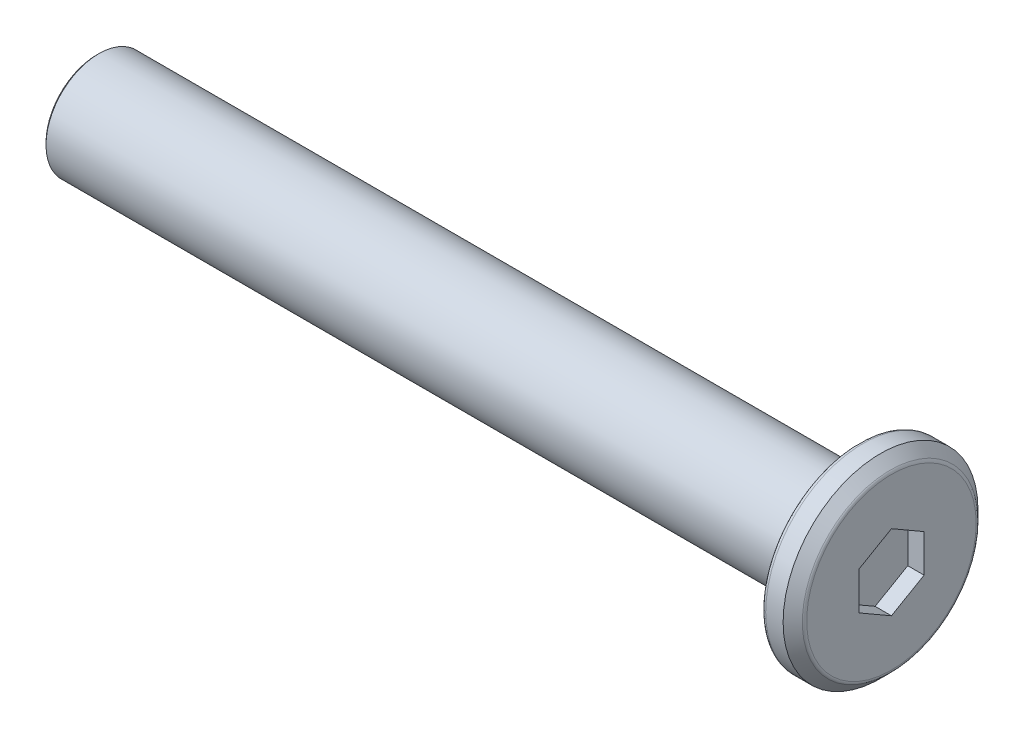
ISO-10303-21;
HEADER;
FILE_DESCRIPTION(('STEP AP214'),'2;1');
FILE_NAME('part.step','',(''),(''),'','','');
FILE_SCHEMA(('AUTOMOTIVE_DESIGN { 1 0 10303 214 1 1 1 1 }'));
ENDSEC;
DATA;
#1=APPLICATION_CONTEXT('core data for automotive mechanical design processes');
#2=APPLICATION_PROTOCOL_DEFINITION('international standard','automotive_design',2000,#1);
#3=PRODUCT_CONTEXT('',#1,'mechanical');
#4=PRODUCT('Part','Part','',(#3));
#5=PRODUCT_RELATED_PRODUCT_CATEGORY('part','',(#4));
#6=PRODUCT_DEFINITION_FORMATION('','',#4);
#7=PRODUCT_DEFINITION_CONTEXT('part definition',#1,'design');
#8=PRODUCT_DEFINITION('design','',#6,#7);
#9=PRODUCT_DEFINITION_SHAPE('','',#8);
#10=(LENGTH_UNIT() NAMED_UNIT(*) SI_UNIT(.MILLI.,.METRE.));
#11=(NAMED_UNIT(*) PLANE_ANGLE_UNIT() SI_UNIT($,.RADIAN.));
#12=(NAMED_UNIT(*) SI_UNIT($,.STERADIAN.) SOLID_ANGLE_UNIT());
#13=UNCERTAINTY_MEASURE_WITH_UNIT(LENGTH_MEASURE(1.E-05),#10,'distance_accuracy_value','');
#14=(GEOMETRIC_REPRESENTATION_CONTEXT(3) GLOBAL_UNCERTAINTY_ASSIGNED_CONTEXT((#13)) GLOBAL_UNIT_ASSIGNED_CONTEXT((#10,
#11,#12)) REPRESENTATION_CONTEXT('',''));
#15=CARTESIAN_POINT('',(0.,0.,0.));
#16=DIRECTION('',(0.,0.,1.));
#17=DIRECTION('',(1.,0.,0.));
#18=AXIS2_PLACEMENT_3D('',#15,#16,#17);
#19=CARTESIAN_POINT('',(16.7014355970759,1.29837341347638,0.250401994321692));
#20=DIRECTION('',(1.,0.,0.));
#21=DIRECTION('',(0.,0.,-1.));
#22=AXIS2_PLACEMENT_3D('',#19,#20,#21);
#23=PLANE('',#22);
#24=CARTESIAN_POINT('',(16.7014355970759,1.29837341347638,0.250401994321692));
#25=DIRECTION('',(1.,0.,0.));
#26=DIRECTION('',(0.,0.,-1.));
#27=AXIS2_PLACEMENT_3D('',#24,#25,#26);
#28=CIRCLE('',#27,3.89215728752538);
#29=CARTESIAN_POINT('',(16.7014355970759,1.29837341347638,-3.64175529320369));
#30=VERTEX_POINT('',#29);
#31=EDGE_CURVE('E132',#30,#30,#28,.T.);
#32=ORIENTED_EDGE('',*,*,#31,.T.);
#33=EDGE_LOOP('',(#32));
#34=FACE_BOUND('',#33,.T.);
#35=DIRECTION('',(0.,-1.,0.));
#36=VECTOR('',#35,1.);
#37=CARTESIAN_POINT('',(16.7014355970759,1.29837341347638,-1.24959800567831));
#38=LINE('',#37,#36);
#39=CARTESIAN_POINT('',(16.7014355970759,2.16439881726082,-1.24959800567831));
#40=VERTEX_POINT('',#39);
#41=CARTESIAN_POINT('',(16.7014355970759,0.432348009691944,-1.24959800567831));
#42=VERTEX_POINT('',#41);
#43=EDGE_CURVE('E120',#40,#42,#38,.T.);
#44=ORIENTED_EDGE('',*,*,#43,.T.);
#45=DIRECTION('',(0.,-0.5,0.866025403784439));
#46=VECTOR('',#45,1.);
#47=CARTESIAN_POINT('',(16.7014355970759,-0.00066469220027501,-0.499598005678308));
#48=LINE('',#47,#46);
#49=CARTESIAN_POINT('',(16.7014355970759,-0.433677394092494,0.250401994321691));
#50=VERTEX_POINT('',#49);
#51=EDGE_CURVE('E40',#42,#50,#48,.T.);
#52=ORIENTED_EDGE('',*,*,#51,.T.);
#53=DIRECTION('',(0.,0.5,0.866025403784439));
#54=VECTOR('',#53,1.);
#55=CARTESIAN_POINT('',(16.7014355970759,-0.000664692200273926,1.00040199432169));
#56=LINE('',#55,#54);
#57=CARTESIAN_POINT('',(16.7014355970759,0.432348009691946,1.75040199432169));
#58=VERTEX_POINT('',#57);
#59=EDGE_CURVE('E76',#50,#58,#56,.T.);
#60=ORIENTED_EDGE('',*,*,#59,.T.);
#61=DIRECTION('',(0.,1.,0.));
#62=VECTOR('',#61,1.);
#63=CARTESIAN_POINT('',(16.7014355970759,1.29837341347638,1.75040199432169));
#64=LINE('',#63,#62);
#65=CARTESIAN_POINT('',(16.7014355970759,2.16439881726082,1.75040199432169));
#66=VERTEX_POINT('',#65);
#67=EDGE_CURVE('E111',#58,#66,#64,.T.);
#68=ORIENTED_EDGE('',*,*,#67,.T.);
#69=DIRECTION('',(0.,0.5,-0.866025403784439));
#70=VECTOR('',#69,1.);
#71=CARTESIAN_POINT('',(16.7014355970759,2.59741151915304,1.00040199432169));
#72=LINE('',#71,#70);
#73=CARTESIAN_POINT('',(16.7014355970759,3.03042422104526,0.250401994321692));
#74=VERTEX_POINT('',#73);
#75=EDGE_CURVE('E114',#66,#74,#72,.T.);
#76=ORIENTED_EDGE('',*,*,#75,.T.);
#77=DIRECTION('',(0.,-0.5,-0.866025403784439));
#78=VECTOR('',#77,1.);
#79=CARTESIAN_POINT('',(16.7014355970759,2.59741151915304,-0.499598005678308));
#80=LINE('',#79,#78);
#81=EDGE_CURVE('E117',#74,#40,#80,.T.);
#82=ORIENTED_EDGE('',*,*,#81,.T.);
#83=EDGE_LOOP('',(#44,#52,#60,#68,#76,#82));
#84=FACE_BOUND('',#83,.T.);
#85=ADVANCED_FACE('F16',(#34,#84),#23,.T.);
#86=CARTESIAN_POINT('',(15.2014355970759,1.29837341347638,0.250401994321692));
#87=DIRECTION('',(1.,0.,0.));
#88=DIRECTION('',(0.,0.,-1.));
#89=AXIS2_PLACEMENT_3D('',#86,#87,#88);
#90=PLANE('',#89);
#91=CARTESIAN_POINT('',(15.2014355970759,1.29837341347638,0.250401994321692));
#92=DIRECTION('',(1.,0.,0.));
#93=DIRECTION('',(0.,0.,-1.));
#94=AXIS2_PLACEMENT_3D('',#91,#92,#93);
#95=CIRCLE('',#94,4.275);
#96=CARTESIAN_POINT('',(15.2014355970759,1.29837341347638,-4.02459800567831));
#97=VERTEX_POINT('',#96);
#98=EDGE_CURVE('E141',#97,#97,#95,.F.);
#99=ORIENTED_EDGE('',*,*,#98,.T.);
#100=EDGE_LOOP('',(#99));
#101=FACE_BOUND('',#100,.T.);
#102=CARTESIAN_POINT('',(15.2014355970759,1.29837341347638,0.250401994321692));
#103=DIRECTION('',(1.,0.,0.));
#104=DIRECTION('',(0.,0.,-1.));
#105=AXIS2_PLACEMENT_3D('',#102,#103,#104);
#106=CIRCLE('',#105,2.675);
#107=CARTESIAN_POINT('',(15.2014355970759,1.29837341347638,-2.42459800567831));
#108=VERTEX_POINT('',#107);
#109=EDGE_CURVE('E129',#108,#108,#106,.T.);
#110=ORIENTED_EDGE('',*,*,#109,.T.);
#111=EDGE_LOOP('',(#110));
#112=FACE_BOUND('',#111,.T.);
#113=ADVANCED_FACE('F159',(#101,#112),#90,.F.);
#114=CARTESIAN_POINT('',(16.7014355970759,1.29837341347638,0.250401994321692));
#115=DIRECTION('',(-1.,0.,0.));
#116=DIRECTION('',(0.,0.,1.));
#117=AXIS2_PLACEMENT_3D('',#114,#115,#116);
#118=CYLINDRICAL_SURFACE('',#117,4.475);
#119=CARTESIAN_POINT('',(15.4014355970759,1.29837341347638,0.250401994321692));
#120=DIRECTION('',(1.,0.,0.));
#121=DIRECTION('',(0.,0.,-1.));
#122=AXIS2_PLACEMENT_3D('',#119,#120,#121);
#123=CIRCLE('',#122,4.475);
#124=CARTESIAN_POINT('',(15.4014355970759,1.29837341347638,-4.22459800567831));
#125=VERTEX_POINT('',#124);
#126=EDGE_CURVE('E138',#125,#125,#123,.T.);
#127=ORIENTED_EDGE('',*,*,#126,.T.);
#128=EDGE_LOOP('',(#127));
#129=FACE_BOUND('',#128,.T.);
#130=CARTESIAN_POINT('',(16.2014355970759,1.29837341347638,0.250401994321692));
#131=DIRECTION('',(1.,0.,0.));
#132=DIRECTION('',(0.,0.,-1.));
#133=AXIS2_PLACEMENT_3D('',#130,#131,#132);
#134=CIRCLE('',#133,4.475);
#135=CARTESIAN_POINT('',(16.2014355970759,1.29837341347638,-4.22459800567831));
#136=VERTEX_POINT('',#135);
#137=EDGE_CURVE('E123',#136,#136,#134,.F.);
#138=ORIENTED_EDGE('',*,*,#137,.T.);
#139=EDGE_LOOP('',(#138));
#140=FACE_BOUND('',#139,.T.);
#141=ADVANCED_FACE('F165',(#129,#140),#118,.T.);
#142=CARTESIAN_POINT('',(-19.7985644029241,1.29837341347638,0.250401994321692));
#143=DIRECTION('',(1.,0.,0.));
#144=DIRECTION('',(0.,0.,-1.));
#145=AXIS2_PLACEMENT_3D('',#142,#143,#144);
#146=CYLINDRICAL_SURFACE('',#145,2.425);
#147=CARTESIAN_POINT('',(-19.6985644029241,1.29837341347638,0.250401994321692));
#148=DIRECTION('',(-1.,0.,0.));
#149=DIRECTION('',(0.,0.,1.));
#150=AXIS2_PLACEMENT_3D('',#147,#148,#149);
#151=CIRCLE('',#150,2.425);
#152=CARTESIAN_POINT('',(-19.6985644029241,1.29837341347638,2.67540199432169));
#153=VERTEX_POINT('',#152);
#154=EDGE_CURVE('E10',#153,#153,#151,.F.);
#155=ORIENTED_EDGE('',*,*,#154,.T.);
#156=EDGE_LOOP('',(#155));
#157=FACE_BOUND('',#156,.T.);
#158=CARTESIAN_POINT('',(14.9514355970759,1.29837341347638,0.250401994321692));
#159=DIRECTION('',(1.,0.,0.));
#160=DIRECTION('',(0.,0.,-1.));
#161=AXIS2_PLACEMENT_3D('',#158,#159,#160);
#162=CIRCLE('',#161,2.425);
#163=CARTESIAN_POINT('',(14.9514355970759,1.29837341347638,-2.17459800567831));
#164=VERTEX_POINT('',#163);
#165=EDGE_CURVE('E126',#164,#164,#162,.F.);
#166=ORIENTED_EDGE('',*,*,#165,.T.);
#167=EDGE_LOOP('',(#166));
#168=FACE_BOUND('',#167,.T.);
#169=ADVANCED_FACE('F170',(#157,#168),#146,.T.);
#170=CARTESIAN_POINT('',(-19.7985644029241,1.29837341347638,0.250401994321692));
#171=DIRECTION('',(-1.,0.,0.));
#172=DIRECTION('',(0.,0.,1.));
#173=AXIS2_PLACEMENT_3D('',#170,#171,#172);
#174=PLANE('',#173);
#175=CARTESIAN_POINT('',(-19.7985644029241,1.29837341347638,0.250401994321692));
#176=DIRECTION('',(-1.,0.,0.));
#177=DIRECTION('',(0.,0.,1.));
#178=AXIS2_PLACEMENT_3D('',#175,#176,#177);
#179=CIRCLE('',#178,2.325);
#180=CARTESIAN_POINT('',(-19.7985644029241,1.29837341347638,2.57540199432169));
#181=VERTEX_POINT('',#180);
#182=EDGE_CURVE('E25',#181,#181,#179,.T.);
#183=ORIENTED_EDGE('',*,*,#182,.T.);
#184=EDGE_LOOP('',(#183));
#185=FACE_BOUND('',#184,.T.);
#186=ADVANCED_FACE('F146',(#185),#174,.T.);
#187=CARTESIAN_POINT('',(17.9514355970759,-0.433677394092494,0.250401994321691));
#188=DIRECTION('',(0.,0.866025403784439,0.5));
#189=DIRECTION('',(0.,-0.5,0.866025403784439));
#190=AXIS2_PLACEMENT_3D('',#187,#188,#189);
#191=PLANE('',#190);
#192=DIRECTION('',(-1.,0.,0.));
#193=VECTOR('',#192,1.);
#194=CARTESIAN_POINT('',(17.9514355970759,0.432348009691944,-1.24959800567831));
#195=LINE('',#194,#193);
#196=CARTESIAN_POINT('',(15.9514355970759,0.432348009691944,-1.24959800567831));
#197=VERTEX_POINT('',#196);
#198=EDGE_CURVE('E69',#42,#197,#195,.T.);
#199=ORIENTED_EDGE('',*,*,#198,.T.);
#200=DIRECTION('',(0.,0.5,-0.866025403784439));
#201=VECTOR('',#200,1.);
#202=CARTESIAN_POINT('',(15.9514355970759,-0.433677394092494,0.250401994321691));
#203=LINE('',#202,#201);
#204=CARTESIAN_POINT('',(15.9514355970759,-0.433677394092494,0.250401994321691));
#205=VERTEX_POINT('',#204);
#206=EDGE_CURVE('E73',#205,#197,#203,.T.);
#207=ORIENTED_EDGE('',*,*,#206,.F.);
#208=DIRECTION('',(-1.,0.,0.));
#209=VECTOR('',#208,1.);
#210=CARTESIAN_POINT('',(17.9514355970759,-0.433677394092494,0.250401994321691));
#211=LINE('',#210,#209);
#212=EDGE_CURVE('E101',#50,#205,#211,.T.);
#213=ORIENTED_EDGE('',*,*,#212,.F.);
#214=ORIENTED_EDGE('',*,*,#51,.F.);
#215=EDGE_LOOP('',(#199,#207,#213,#214));
#216=FACE_BOUND('',#215,.T.);
#217=ADVANCED_FACE('F71',(#216),#191,.T.);
#218=CARTESIAN_POINT('',(17.9514355970759,0.432348009691944,-1.24959800567831));
#219=DIRECTION('',(0.,0.,1.));
#220=DIRECTION('',(1.,0.,0.));
#221=AXIS2_PLACEMENT_3D('',#218,#219,#220);
#222=PLANE('',#221);
#223=DIRECTION('',(-1.,0.,0.));
#224=VECTOR('',#223,1.);
#225=CARTESIAN_POINT('',(17.9514355970759,2.16439881726082,-1.24959800567831));
#226=LINE('',#225,#224);
#227=CARTESIAN_POINT('',(15.9514355970759,2.16439881726082,-1.24959800567831));
#228=VERTEX_POINT('',#227);
#229=EDGE_CURVE('E77',#40,#228,#226,.T.);
#230=ORIENTED_EDGE('',*,*,#229,.T.);
#231=DIRECTION('',(0.,1.,0.));
#232=VECTOR('',#231,1.);
#233=CARTESIAN_POINT('',(15.9514355970759,0.432348009691944,-1.24959800567831));
#234=LINE('',#233,#232);
#235=EDGE_CURVE('E80',#197,#228,#234,.T.);
#236=ORIENTED_EDGE('',*,*,#235,.F.);
#237=ORIENTED_EDGE('',*,*,#198,.F.);
#238=ORIENTED_EDGE('',*,*,#43,.F.);
#239=EDGE_LOOP('',(#230,#236,#237,#238));
#240=FACE_BOUND('',#239,.T.);
#241=ADVANCED_FACE('F81',(#240),#222,.T.);
#242=CARTESIAN_POINT('',(17.9514355970759,2.16439881726082,-1.24959800567831));
#243=DIRECTION('',(0.,-0.866025403784439,0.5));
#244=DIRECTION('',(0.,-0.5,-0.866025403784439));
#245=AXIS2_PLACEMENT_3D('',#242,#243,#244);
#246=PLANE('',#245);
#247=DIRECTION('',(-1.,0.,0.));
#248=VECTOR('',#247,1.);
#249=CARTESIAN_POINT('',(17.9514355970759,3.03042422104526,0.250401994321692));
#250=LINE('',#249,#248);
#251=CARTESIAN_POINT('',(15.9514355970759,3.03042422104526,0.250401994321692));
#252=VERTEX_POINT('',#251);
#253=EDGE_CURVE('E106',#74,#252,#250,.T.);
#254=ORIENTED_EDGE('',*,*,#253,.T.);
#255=DIRECTION('',(0.,0.5,0.866025403784438));
#256=VECTOR('',#255,1.);
#257=CARTESIAN_POINT('',(15.9514355970759,2.16439881726082,-1.24959800567831));
#258=LINE('',#257,#256);
#259=EDGE_CURVE('E86',#228,#252,#258,.T.);
#260=ORIENTED_EDGE('',*,*,#259,.F.);
#261=ORIENTED_EDGE('',*,*,#229,.F.);
#262=ORIENTED_EDGE('',*,*,#81,.F.);
#263=EDGE_LOOP('',(#254,#260,#261,#262));
#264=FACE_BOUND('',#263,.T.);
#265=ADVANCED_FACE('F257',(#264),#246,.T.);
#266=CARTESIAN_POINT('',(17.9514355970759,3.03042422104526,0.250401994321692));
#267=DIRECTION('',(0.,-0.866025403784439,-0.5));
#268=DIRECTION('',(0.,0.5,-0.866025403784439));
#269=AXIS2_PLACEMENT_3D('',#266,#267,#268);
#270=PLANE('',#269);
#271=DIRECTION('',(-1.,0.,0.));
#272=VECTOR('',#271,1.);
#273=CARTESIAN_POINT('',(17.9514355970759,2.16439881726082,1.75040199432169));
#274=LINE('',#273,#272);
#275=CARTESIAN_POINT('',(15.9514355970759,2.16439881726082,1.75040199432169));
#276=VERTEX_POINT('',#275);
#277=EDGE_CURVE('E104',#66,#276,#274,.T.);
#278=ORIENTED_EDGE('',*,*,#277,.T.);
#279=DIRECTION('',(0.,-0.5,0.866025403784439));
#280=VECTOR('',#279,1.);
#281=CARTESIAN_POINT('',(15.9514355970759,3.03042422104526,0.250401994321692));
#282=LINE('',#281,#280);
#283=EDGE_CURVE('E95',#252,#276,#282,.T.);
#284=ORIENTED_EDGE('',*,*,#283,.F.);
#285=ORIENTED_EDGE('',*,*,#253,.F.);
#286=ORIENTED_EDGE('',*,*,#75,.F.);
#287=EDGE_LOOP('',(#278,#284,#285,#286));
#288=FACE_BOUND('',#287,.T.);
#289=ADVANCED_FACE('F248',(#288),#270,.T.);
#290=CARTESIAN_POINT('',(17.9514355970759,2.16439881726082,1.75040199432169));
#291=DIRECTION('',(0.,0.,-1.));
#292=DIRECTION('',(-1.,0.,0.));
#293=AXIS2_PLACEMENT_3D('',#290,#291,#292);
#294=PLANE('',#293);
#295=DIRECTION('',(-1.,0.,0.));
#296=VECTOR('',#295,1.);
#297=CARTESIAN_POINT('',(17.9514355970759,0.432348009691945,1.75040199432169));
#298=LINE('',#297,#296);
#299=CARTESIAN_POINT('',(15.9514355970759,0.432348009691945,1.75040199432169));
#300=VERTEX_POINT('',#299);
#301=EDGE_CURVE('E32',#58,#300,#298,.T.);
#302=ORIENTED_EDGE('',*,*,#301,.T.);
#303=DIRECTION('',(0.,-1.,0.));
#304=VECTOR('',#303,1.);
#305=CARTESIAN_POINT('',(15.9514355970759,2.16439881726082,1.75040199432169));
#306=LINE('',#305,#304);
#307=EDGE_CURVE('E98',#276,#300,#306,.T.);
#308=ORIENTED_EDGE('',*,*,#307,.F.);
#309=ORIENTED_EDGE('',*,*,#277,.F.);
#310=ORIENTED_EDGE('',*,*,#67,.F.);
#311=EDGE_LOOP('',(#302,#308,#309,#310));
#312=FACE_BOUND('',#311,.T.);
#313=ADVANCED_FACE('F240',(#312),#294,.T.);
#314=CARTESIAN_POINT('',(17.9514355970759,0.432348009691945,1.75040199432169));
#315=DIRECTION('',(0.,0.866025403784438,-0.5));
#316=DIRECTION('',(0.,0.5,0.866025403784439));
#317=AXIS2_PLACEMENT_3D('',#314,#315,#316);
#318=PLANE('',#317);
#319=ORIENTED_EDGE('',*,*,#212,.T.);
#320=DIRECTION('',(0.,-0.5,-0.866025403784438));
#321=VECTOR('',#320,1.);
#322=CARTESIAN_POINT('',(15.9514355970759,0.432348009691945,1.75040199432169));
#323=LINE('',#322,#321);
#324=EDGE_CURVE('E91',#300,#205,#323,.T.);
#325=ORIENTED_EDGE('',*,*,#324,.F.);
#326=ORIENTED_EDGE('',*,*,#301,.F.);
#327=ORIENTED_EDGE('',*,*,#59,.F.);
#328=EDGE_LOOP('',(#319,#325,#326,#327));
#329=FACE_BOUND('',#328,.T.);
#330=ADVANCED_FACE('F232',(#329),#318,.T.);
#331=CARTESIAN_POINT('',(15.9514355970759,1.29837341347638,0.250401994321692));
#332=DIRECTION('',(1.,0.,0.));
#333=DIRECTION('',(0.,0.,-1.));
#334=AXIS2_PLACEMENT_3D('',#331,#332,#333);
#335=PLANE('',#334);
#336=ORIENTED_EDGE('',*,*,#206,.T.);
#337=ORIENTED_EDGE('',*,*,#235,.T.);
#338=ORIENTED_EDGE('',*,*,#259,.T.);
#339=ORIENTED_EDGE('',*,*,#283,.T.);
#340=ORIENTED_EDGE('',*,*,#307,.T.);
#341=ORIENTED_EDGE('',*,*,#324,.T.);
#342=EDGE_LOOP('',(#336,#337,#338,#339,#340,#341));
#343=FACE_BOUND('',#342,.T.);
#344=ADVANCED_FACE('F89',(#343),#335,.T.);
#345=CARTESIAN_POINT('',(16.7014355970759,1.29837341347638,0.250401994321692));
#346=DIRECTION('',(-1.,0.,0.));
#347=DIRECTION('',(0.,0.,1.));
#348=AXIS2_PLACEMENT_3D('',#345,#346,#347);
#349=CONICAL_SURFACE('',#348,3.975,0.785398163397449);
#350=CARTESIAN_POINT('',(16.6428569533133,1.29837341347638,0.250401994321692));
#351=DIRECTION('',(1.,0.,0.));
#352=DIRECTION('',(0.,0.,-1.));
#353=AXIS2_PLACEMENT_3D('',#350,#351,#352);
#354=CIRCLE('',#353,4.03357864376269);
#355=CARTESIAN_POINT('',(16.6428569533133,1.29837341347638,-3.78317664944099));
#356=VERTEX_POINT('',#355);
#357=EDGE_CURVE('E135',#356,#356,#354,.F.);
#358=ORIENTED_EDGE('',*,*,#357,.T.);
#359=EDGE_LOOP('',(#358));
#360=FACE_BOUND('',#359,.T.);
#361=ORIENTED_EDGE('',*,*,#137,.F.);
#362=EDGE_LOOP('',(#361));
#363=FACE_BOUND('',#362,.T.);
#364=ADVANCED_FACE('F176',(#360,#363),#349,.T.);
#365=CARTESIAN_POINT('',(14.9514355970759,1.29837341347638,0.250401994321692));
#366=DIRECTION('',(1.,0.,0.));
#367=DIRECTION('',(0.,0.,-1.));
#368=AXIS2_PLACEMENT_3D('',#365,#366,#367);
#369=TOROIDAL_SURFACE('',#368,2.675,0.25);
#370=ORIENTED_EDGE('',*,*,#109,.F.);
#371=EDGE_LOOP('',(#370));
#372=FACE_BOUND('',#371,.T.);
#373=ORIENTED_EDGE('',*,*,#165,.F.);
#374=EDGE_LOOP('',(#373));
#375=FACE_BOUND('',#374,.T.);
#376=ADVANCED_FACE('F179',(#372,#375),#369,.F.);
#377=CARTESIAN_POINT('',(16.5014355970759,1.29837341347638,0.250401994321692));
#378=DIRECTION('',(1.,0.,0.));
#379=DIRECTION('',(0.,0.,-1.));
#380=AXIS2_PLACEMENT_3D('',#377,#378,#379);
#381=TOROIDAL_SURFACE('',#380,3.89215728752538,0.2);
#382=ORIENTED_EDGE('',*,*,#357,.F.);
#383=EDGE_LOOP('',(#382));
#384=FACE_BOUND('',#383,.T.);
#385=ORIENTED_EDGE('',*,*,#31,.F.);
#386=EDGE_LOOP('',(#385));
#387=FACE_BOUND('',#386,.T.);
#388=ADVANCED_FACE('F155',(#384,#387),#381,.T.);
#389=CARTESIAN_POINT('',(15.4014355970759,1.29837341347638,0.250401994321692));
#390=DIRECTION('',(1.,0.,0.));
#391=DIRECTION('',(0.,0.,-1.));
#392=AXIS2_PLACEMENT_3D('',#389,#390,#391);
#393=TOROIDAL_SURFACE('',#392,4.275,0.2);
#394=ORIENTED_EDGE('',*,*,#98,.F.);
#395=EDGE_LOOP('',(#394));
#396=FACE_BOUND('',#395,.T.);
#397=ORIENTED_EDGE('',*,*,#126,.F.);
#398=EDGE_LOOP('',(#397));
#399=FACE_BOUND('',#398,.T.);
#400=ADVANCED_FACE('F149',(#396,#399),#393,.T.);
#401=CARTESIAN_POINT('',(-19.7985644029241,1.29837341347638,0.250401994321692));
#402=DIRECTION('',(1.,0.,0.));
#403=DIRECTION('',(0.,0.,-1.));
#404=AXIS2_PLACEMENT_3D('',#401,#402,#403);
#405=CONICAL_SURFACE('',#404,2.325,0.785398163397466);
#406=ORIENTED_EDGE('',*,*,#154,.F.);
#407=EDGE_LOOP('',(#406));
#408=FACE_BOUND('',#407,.T.);
#409=ORIENTED_EDGE('',*,*,#182,.F.);
#410=EDGE_LOOP('',(#409));
#411=FACE_BOUND('',#410,.T.);
#412=ADVANCED_FACE('F19',(#408,#411),#405,.T.);
#413=CLOSED_SHELL('',(#85,#113,#141,#169,#186,#217,#241,#265,#289,#313,#330,#344,#364,#376,#388,
#400,#412));
#414=MANIFOLD_SOLID_BREP('B1',#413);
#415=ADVANCED_BREP_SHAPE_REPRESENTATION('',(#18,#414),#14);
#416=SHAPE_DEFINITION_REPRESENTATION(#9,#415);
ENDSEC;
END-ISO-10303-21;
